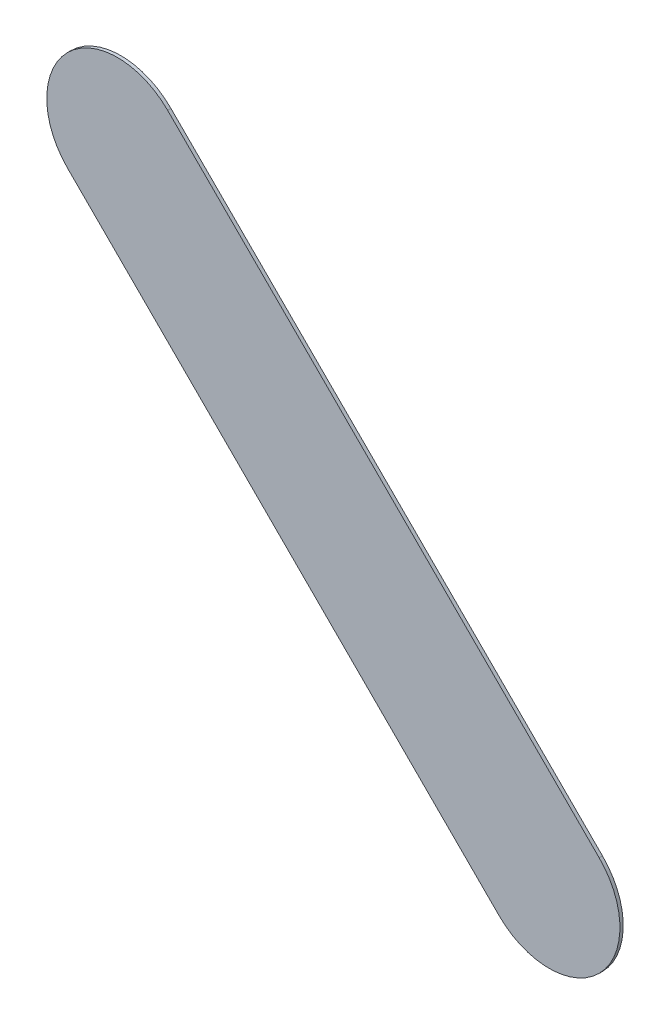
ISO-10303-21;
HEADER;
FILE_DESCRIPTION(('STEP AP214'),'2;1');
FILE_NAME('part.step','',(''),(''),'','','');
FILE_SCHEMA(('AUTOMOTIVE_DESIGN { 1 0 10303 214 1 1 1 1 }'));
ENDSEC;
DATA;
#1=APPLICATION_CONTEXT('core data for automotive mechanical design processes');
#2=APPLICATION_PROTOCOL_DEFINITION('international standard','automotive_design',2000,#1);
#3=PRODUCT_CONTEXT('',#1,'mechanical');
#4=PRODUCT('Part','Part','',(#3));
#5=PRODUCT_RELATED_PRODUCT_CATEGORY('part','',(#4));
#6=PRODUCT_DEFINITION_FORMATION('','',#4);
#7=PRODUCT_DEFINITION_CONTEXT('part definition',#1,'design');
#8=PRODUCT_DEFINITION('design','',#6,#7);
#9=PRODUCT_DEFINITION_SHAPE('','',#8);
#10=(LENGTH_UNIT() NAMED_UNIT(*) SI_UNIT(.MILLI.,.METRE.));
#11=(NAMED_UNIT(*) PLANE_ANGLE_UNIT() SI_UNIT($,.RADIAN.));
#12=(NAMED_UNIT(*) SI_UNIT($,.STERADIAN.) SOLID_ANGLE_UNIT());
#13=UNCERTAINTY_MEASURE_WITH_UNIT(LENGTH_MEASURE(1.E-05),#10,'distance_accuracy_value','');
#14=(GEOMETRIC_REPRESENTATION_CONTEXT(3) GLOBAL_UNCERTAINTY_ASSIGNED_CONTEXT((#13)) GLOBAL_UNIT_ASSIGNED_CONTEXT((#10,
#11,#12)) REPRESENTATION_CONTEXT('',''));
#15=CARTESIAN_POINT('',(0.,0.,0.));
#16=DIRECTION('',(0.,0.,1.));
#17=DIRECTION('',(1.,0.,0.));
#18=AXIS2_PLACEMENT_3D('',#15,#16,#17);
#19=CARTESIAN_POINT('',(122.95833,-117.833669,0.));
#20=DIRECTION('',(0.,0.,1.));
#21=DIRECTION('',(1.,0.,0.));
#22=AXIS2_PLACEMENT_3D('',#19,#20,#21);
#23=PLANE('',#22);
#24=DIRECTION('',(-0.707106781186548,0.707106781186548,0.));
#25=VECTOR('',#24,1.);
#26=CARTESIAN_POINT('',(122.95833,-117.833669,0.));
#27=LINE('',#26,#25);
#28=CARTESIAN_POINT('',(122.95833,-117.833669,0.));
#29=VERTEX_POINT('',#28);
#30=CARTESIAN_POINT('',(118.38633,-113.261669,0.));
#31=VERTEX_POINT('',#30);
#32=EDGE_CURVE('E81',#29,#31,#27,.T.);
#33=ORIENTED_EDGE('',*,*,#32,.T.);
#34=CARTESIAN_POINT('',(117.8559995,-113.7919995,0.));
#35=DIRECTION('',(0.,0.,1.));
#36=DIRECTION('',(0.707106781186548,0.707106781186548,0.));
#37=AXIS2_PLACEMENT_3D('',#34,#35,#36);
#38=CIRCLE('',#37,0.75000058564);
#39=CARTESIAN_POINT('',(117.325669,-114.32233,0.));
#40=VERTEX_POINT('',#39);
#41=EDGE_CURVE('E102',#31,#40,#38,.T.);
#42=ORIENTED_EDGE('',*,*,#41,.T.);
#43=DIRECTION('',(0.707106781186548,-0.707106781186548,0.));
#44=VECTOR('',#43,1.);
#45=CARTESIAN_POINT('',(117.325669,-114.32233,0.));
#46=LINE('',#45,#44);
#47=CARTESIAN_POINT('',(121.897669,-118.89433,0.));
#48=VERTEX_POINT('',#47);
#49=EDGE_CURVE('E74',#40,#48,#46,.T.);
#50=ORIENTED_EDGE('',*,*,#49,.T.);
#51=CARTESIAN_POINT('',(122.4279995,-118.3639995,0.));
#52=DIRECTION('',(0.,0.,1.));
#53=DIRECTION('',(-0.707106781186548,-0.707106781186548,0.));
#54=AXIS2_PLACEMENT_3D('',#51,#52,#53);
#55=CIRCLE('',#54,0.75000058564);
#56=EDGE_CURVE('E11',#48,#29,#55,.T.);
#57=ORIENTED_EDGE('',*,*,#56,.T.);
#58=EDGE_LOOP('',(#33,#42,#50,#57));
#59=FACE_BOUND('',#58,.T.);
#60=ADVANCED_FACE('F17',(#59),#23,.T.);
#61=CARTESIAN_POINT('',(122.95833,-117.833669,-0.035));
#62=DIRECTION('',(0.,0.,1.));
#63=DIRECTION('',(1.,0.,0.));
#64=AXIS2_PLACEMENT_3D('',#61,#62,#63);
#65=PLANE('',#64);
#66=CARTESIAN_POINT('',(122.4279995,-118.3639995,-0.035));
#67=DIRECTION('',(0.,0.,1.));
#68=DIRECTION('',(-0.707106781186548,-0.707106781186548,0.));
#69=AXIS2_PLACEMENT_3D('',#66,#67,#68);
#70=CIRCLE('',#69,0.75000058564);
#71=CARTESIAN_POINT('',(121.897669,-118.89433,-0.035));
#72=VERTEX_POINT('',#71);
#73=CARTESIAN_POINT('',(122.95833,-117.833669,-0.035));
#74=VERTEX_POINT('',#73);
#75=EDGE_CURVE('E25',#72,#74,#70,.T.);
#76=ORIENTED_EDGE('',*,*,#75,.F.);
#77=DIRECTION('',(0.707106781186548,-0.707106781186548,0.));
#78=VECTOR('',#77,1.);
#79=CARTESIAN_POINT('',(117.325669,-114.32233,-0.035));
#80=LINE('',#79,#78);
#81=CARTESIAN_POINT('',(117.325669,-114.32233,-0.035));
#82=VERTEX_POINT('',#81);
#83=EDGE_CURVE('E106',#82,#72,#80,.T.);
#84=ORIENTED_EDGE('',*,*,#83,.F.);
#85=CARTESIAN_POINT('',(117.8559995,-113.7919995,-0.035));
#86=DIRECTION('',(0.,0.,1.));
#87=DIRECTION('',(0.707106781186548,0.707106781186548,0.));
#88=AXIS2_PLACEMENT_3D('',#85,#86,#87);
#89=CIRCLE('',#88,0.75000058564);
#90=CARTESIAN_POINT('',(118.38633,-113.261669,-0.035));
#91=VERTEX_POINT('',#90);
#92=EDGE_CURVE('E83',#91,#82,#89,.T.);
#93=ORIENTED_EDGE('',*,*,#92,.F.);
#94=DIRECTION('',(-0.707106781186548,0.707106781186548,0.));
#95=VECTOR('',#94,1.);
#96=CARTESIAN_POINT('',(122.95833,-117.833669,-0.035));
#97=LINE('',#96,#95);
#98=EDGE_CURVE('E79',#74,#91,#97,.T.);
#99=ORIENTED_EDGE('',*,*,#98,.F.);
#100=EDGE_LOOP('',(#76,#84,#93,#99));
#101=FACE_BOUND('',#100,.T.);
#102=ADVANCED_FACE('F85',(#101),#65,.F.);
#103=CARTESIAN_POINT('',(122.4279995,-118.3639995,-0.035));
#104=DIRECTION('',(0.,0.,-1.));
#105=DIRECTION('',(-0.707106781186548,-0.707106781186548,0.));
#106=AXIS2_PLACEMENT_3D('',#103,#104,#105);
#107=CYLINDRICAL_SURFACE('',#106,0.75000058564);
#108=ORIENTED_EDGE('',*,*,#75,.T.);
#109=DIRECTION('',(0.,0.,1.));
#110=VECTOR('',#109,1.);
#111=CARTESIAN_POINT('',(122.95833,-117.833669,-0.035));
#112=LINE('',#111,#110);
#113=EDGE_CURVE('E68',#74,#29,#112,.T.);
#114=ORIENTED_EDGE('',*,*,#113,.T.);
#115=ORIENTED_EDGE('',*,*,#56,.F.);
#116=DIRECTION('',(0.,0.,1.));
#117=VECTOR('',#116,1.);
#118=CARTESIAN_POINT('',(121.897669,-118.89433,-0.035));
#119=LINE('',#118,#117);
#120=EDGE_CURVE('E71',#72,#48,#119,.T.);
#121=ORIENTED_EDGE('',*,*,#120,.F.);
#122=EDGE_LOOP('',(#108,#114,#115,#121));
#123=FACE_BOUND('',#122,.T.);
#124=ADVANCED_FACE('F67',(#123),#107,.T.);
#125=CARTESIAN_POINT('',(117.325669,-114.32233,-0.035));
#126=DIRECTION('',(0.707106781186548,0.707106781186548,0.));
#127=DIRECTION('',(0.,0.,-1.));
#128=AXIS2_PLACEMENT_3D('',#125,#126,#127);
#129=PLANE('',#128);
#130=ORIENTED_EDGE('',*,*,#83,.T.);
#131=ORIENTED_EDGE('',*,*,#120,.T.);
#132=ORIENTED_EDGE('',*,*,#49,.F.);
#133=DIRECTION('',(0.,0.,1.));
#134=VECTOR('',#133,1.);
#135=CARTESIAN_POINT('',(117.325669,-114.32233,-0.035));
#136=LINE('',#135,#134);
#137=EDGE_CURVE('E101',#82,#40,#136,.T.);
#138=ORIENTED_EDGE('',*,*,#137,.F.);
#139=EDGE_LOOP('',(#130,#131,#132,#138));
#140=FACE_BOUND('',#139,.T.);
#141=ADVANCED_FACE('F120',(#140),#129,.F.);
#142=CARTESIAN_POINT('',(117.8559995,-113.7919995,-0.035));
#143=DIRECTION('',(0.,0.,-1.));
#144=DIRECTION('',(0.707106781186548,0.707106781186548,0.));
#145=AXIS2_PLACEMENT_3D('',#142,#143,#144);
#146=CYLINDRICAL_SURFACE('',#145,0.75000058564);
#147=ORIENTED_EDGE('',*,*,#92,.T.);
#148=ORIENTED_EDGE('',*,*,#137,.T.);
#149=ORIENTED_EDGE('',*,*,#41,.F.);
#150=DIRECTION('',(0.,0.,1.));
#151=VECTOR('',#150,1.);
#152=CARTESIAN_POINT('',(118.38633,-113.261669,-0.035));
#153=LINE('',#152,#151);
#154=EDGE_CURVE('E89',#91,#31,#153,.T.);
#155=ORIENTED_EDGE('',*,*,#154,.F.);
#156=EDGE_LOOP('',(#147,#148,#149,#155));
#157=FACE_BOUND('',#156,.T.);
#158=ADVANCED_FACE('F122',(#157),#146,.T.);
#159=CARTESIAN_POINT('',(122.95833,-117.833669,-0.035));
#160=DIRECTION('',(-0.707106781186548,-0.707106781186548,0.));
#161=DIRECTION('',(-0.707106781186548,0.707106781186548,0.));
#162=AXIS2_PLACEMENT_3D('',#159,#160,#161);
#163=PLANE('',#162);
#164=ORIENTED_EDGE('',*,*,#98,.T.);
#165=ORIENTED_EDGE('',*,*,#154,.T.);
#166=ORIENTED_EDGE('',*,*,#32,.F.);
#167=ORIENTED_EDGE('',*,*,#113,.F.);
#168=EDGE_LOOP('',(#164,#165,#166,#167));
#169=FACE_BOUND('',#168,.T.);
#170=ADVANCED_FACE('F77',(#169),#163,.F.);
#171=CLOSED_SHELL('',(#60,#102,#124,#141,#158,#170));
#172=MANIFOLD_SOLID_BREP('B1',#171);
#173=ADVANCED_BREP_SHAPE_REPRESENTATION('',(#18,#172),#14);
#174=SHAPE_DEFINITION_REPRESENTATION(#9,#173);
ENDSEC;
END-ISO-10303-21;
